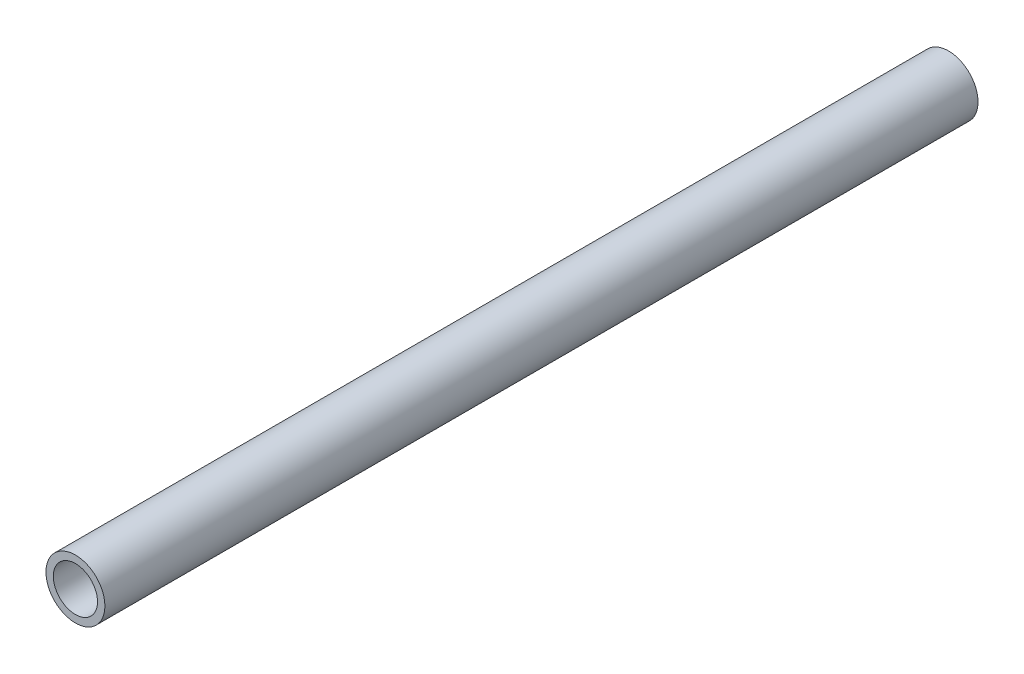
ISO-10303-21;
HEADER;
FILE_DESCRIPTION(('STEP AP214'),'2;1');
FILE_NAME('part.step','',(''),(''),'','','');
FILE_SCHEMA(('AUTOMOTIVE_DESIGN { 1 0 10303 214 1 1 1 1 }'));
ENDSEC;
DATA;
#1=APPLICATION_CONTEXT('core data for automotive mechanical design processes');
#2=APPLICATION_PROTOCOL_DEFINITION('international standard','automotive_design',2000,#1);
#3=PRODUCT_CONTEXT('',#1,'mechanical');
#4=PRODUCT('Part','Part','',(#3));
#5=PRODUCT_RELATED_PRODUCT_CATEGORY('part','',(#4));
#6=PRODUCT_DEFINITION_FORMATION('','',#4);
#7=PRODUCT_DEFINITION_CONTEXT('part definition',#1,'design');
#8=PRODUCT_DEFINITION('design','',#6,#7);
#9=PRODUCT_DEFINITION_SHAPE('','',#8);
#10=(LENGTH_UNIT() NAMED_UNIT(*) SI_UNIT(.MILLI.,.METRE.));
#11=(NAMED_UNIT(*) PLANE_ANGLE_UNIT() SI_UNIT($,.RADIAN.));
#12=(NAMED_UNIT(*) SI_UNIT($,.STERADIAN.) SOLID_ANGLE_UNIT());
#13=UNCERTAINTY_MEASURE_WITH_UNIT(LENGTH_MEASURE(1.E-05),#10,'distance_accuracy_value','');
#14=(GEOMETRIC_REPRESENTATION_CONTEXT(3) GLOBAL_UNCERTAINTY_ASSIGNED_CONTEXT((#13)) GLOBAL_UNIT_ASSIGNED_CONTEXT((#10,
#11,#12)) REPRESENTATION_CONTEXT('',''));
#15=CARTESIAN_POINT('',(0.,0.,0.));
#16=DIRECTION('',(0.,0.,1.));
#17=DIRECTION('',(1.,0.,0.));
#18=AXIS2_PLACEMENT_3D('',#15,#16,#17);
#19=CARTESIAN_POINT('',(0.,0.,237.));
#20=DIRECTION('',(0.,0.,1.));
#21=DIRECTION('',(1.,0.,0.));
#22=AXIS2_PLACEMENT_3D('',#19,#20,#21);
#23=PLANE('',#22);
#24=CARTESIAN_POINT('',(0.,0.,237.));
#25=DIRECTION('',(0.,0.,1.));
#26=DIRECTION('',(1.,0.,0.));
#27=AXIS2_PLACEMENT_3D('',#24,#25,#26);
#28=CIRCLE('',#27,8.);
#29=CARTESIAN_POINT('',(8.,0.,237.));
#30=VERTEX_POINT('',#29);
#31=EDGE_CURVE('E10',#30,#30,#28,.T.);
#32=ORIENTED_EDGE('',*,*,#31,.T.);
#33=EDGE_LOOP('',(#32));
#34=FACE_BOUND('',#33,.T.);
#35=CARTESIAN_POINT('',(0.,0.,237.));
#36=DIRECTION('',(0.,0.,1.));
#37=DIRECTION('',(1.,0.,0.));
#38=AXIS2_PLACEMENT_3D('',#35,#36,#37);
#39=CIRCLE('',#38,6.);
#40=CARTESIAN_POINT('',(6.,0.,237.));
#41=VERTEX_POINT('',#40);
#42=EDGE_CURVE('E43',#41,#41,#39,.T.);
#43=ORIENTED_EDGE('',*,*,#42,.F.);
#44=EDGE_LOOP('',(#43));
#45=FACE_BOUND('',#44,.T.);
#46=ADVANCED_FACE('F32',(#34,#45),#23,.T.);
#47=CARTESIAN_POINT('',(0.,0.,0.));
#48=DIRECTION('',(0.,0.,1.));
#49=DIRECTION('',(1.,0.,0.));
#50=AXIS2_PLACEMENT_3D('',#47,#48,#49);
#51=PLANE('',#50);
#52=CARTESIAN_POINT('',(0.,0.,0.));
#53=DIRECTION('',(0.,0.,1.));
#54=DIRECTION('',(1.,0.,0.));
#55=AXIS2_PLACEMENT_3D('',#52,#53,#54);
#56=CIRCLE('',#55,8.);
#57=CARTESIAN_POINT('',(8.,0.,0.));
#58=VERTEX_POINT('',#57);
#59=EDGE_CURVE('E36',#58,#58,#56,.T.);
#60=ORIENTED_EDGE('',*,*,#59,.F.);
#61=EDGE_LOOP('',(#60));
#62=FACE_BOUND('',#61,.T.);
#63=CARTESIAN_POINT('',(0.,0.,0.));
#64=DIRECTION('',(0.,0.,1.));
#65=DIRECTION('',(1.,0.,0.));
#66=AXIS2_PLACEMENT_3D('',#63,#64,#65);
#67=CIRCLE('',#66,6.);
#68=CARTESIAN_POINT('',(6.,0.,0.));
#69=VERTEX_POINT('',#68);
#70=EDGE_CURVE('E45',#69,#69,#67,.T.);
#71=ORIENTED_EDGE('',*,*,#70,.T.);
#72=EDGE_LOOP('',(#71));
#73=FACE_BOUND('',#72,.T.);
#74=ADVANCED_FACE('F55',(#62,#73),#51,.F.);
#75=CARTESIAN_POINT('',(0.,0.,237.));
#76=DIRECTION('',(0.,0.,-1.));
#77=DIRECTION('',(-1.,0.,0.));
#78=AXIS2_PLACEMENT_3D('',#75,#76,#77);
#79=CYLINDRICAL_SURFACE('',#78,8.);
#80=ORIENTED_EDGE('',*,*,#31,.F.);
#81=EDGE_LOOP('',(#80));
#82=FACE_BOUND('',#81,.T.);
#83=ORIENTED_EDGE('',*,*,#59,.T.);
#84=EDGE_LOOP('',(#83));
#85=FACE_BOUND('',#84,.T.);
#86=ADVANCED_FACE('F34',(#82,#85),#79,.T.);
#87=CARTESIAN_POINT('',(0.,0.,237.));
#88=DIRECTION('',(0.,0.,-1.));
#89=DIRECTION('',(-1.,0.,0.));
#90=AXIS2_PLACEMENT_3D('',#87,#88,#89);
#91=CYLINDRICAL_SURFACE('',#90,6.);
#92=ORIENTED_EDGE('',*,*,#42,.T.);
#93=EDGE_LOOP('',(#92));
#94=FACE_BOUND('',#93,.T.);
#95=ORIENTED_EDGE('',*,*,#70,.F.);
#96=EDGE_LOOP('',(#95));
#97=FACE_BOUND('',#96,.T.);
#98=ADVANCED_FACE('F51',(#94,#97),#91,.F.);
#99=CLOSED_SHELL('',(#46,#74,#86,#98));
#100=MANIFOLD_SOLID_BREP('B2',#99);
#101=ADVANCED_BREP_SHAPE_REPRESENTATION('',(#18,#100),#14);
#102=SHAPE_DEFINITION_REPRESENTATION(#9,#101);
ENDSEC;
END-ISO-10303-21;
